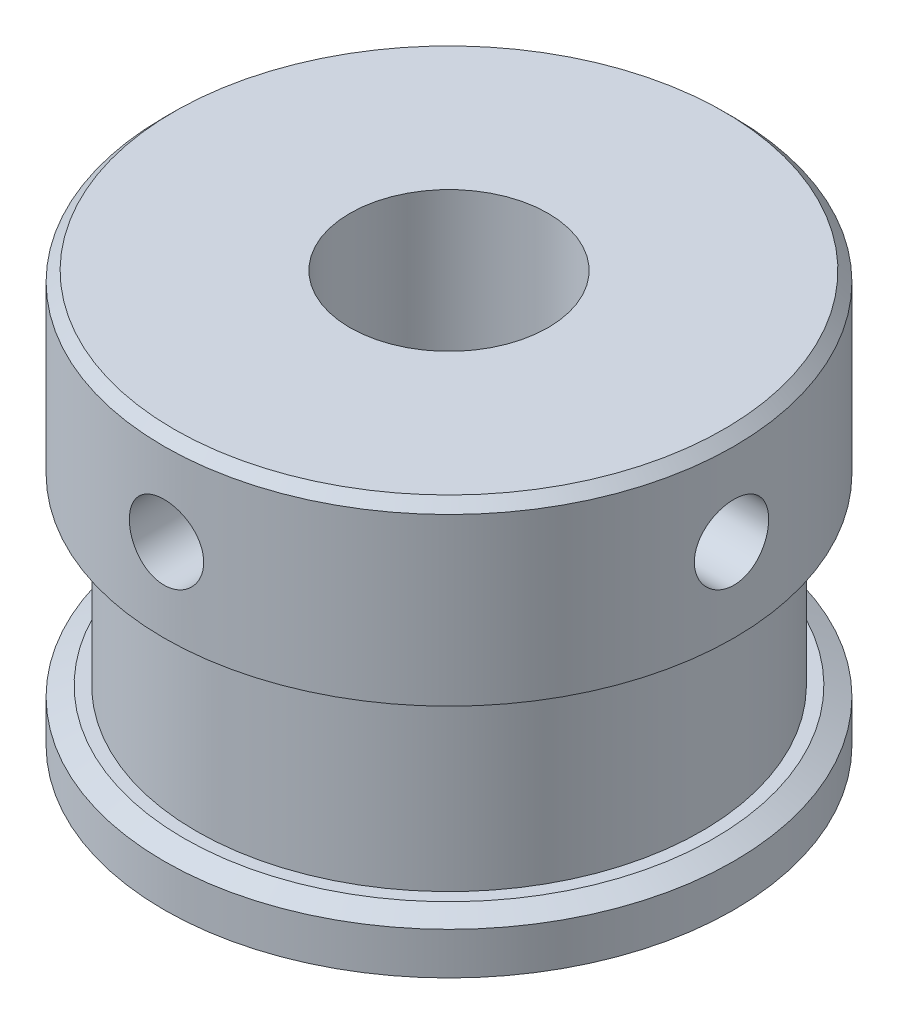
ISO-10303-21;
HEADER;
FILE_DESCRIPTION(('STEP AP214'),'2;1');
FILE_NAME('part.step','',(''),(''),'','','');
FILE_SCHEMA(('AUTOMOTIVE_DESIGN { 1 0 10303 214 1 1 1 1 }'));
ENDSEC;
DATA;
#1=APPLICATION_CONTEXT('core data for automotive mechanical design processes');
#2=APPLICATION_PROTOCOL_DEFINITION('international standard','automotive_design',2000,#1);
#3=PRODUCT_CONTEXT('',#1,'mechanical');
#4=PRODUCT('Part','Part','',(#3));
#5=PRODUCT_RELATED_PRODUCT_CATEGORY('part','',(#4));
#6=PRODUCT_DEFINITION_FORMATION('','',#4);
#7=PRODUCT_DEFINITION_CONTEXT('part definition',#1,'design');
#8=PRODUCT_DEFINITION('design','',#6,#7);
#9=PRODUCT_DEFINITION_SHAPE('','',#8);
#10=(LENGTH_UNIT() NAMED_UNIT(*) SI_UNIT(.MILLI.,.METRE.));
#11=(NAMED_UNIT(*) PLANE_ANGLE_UNIT() SI_UNIT($,.RADIAN.));
#12=(NAMED_UNIT(*) SI_UNIT($,.STERADIAN.) SOLID_ANGLE_UNIT());
#13=UNCERTAINTY_MEASURE_WITH_UNIT(LENGTH_MEASURE(1.E-05),#10,'distance_accuracy_value','');
#14=(GEOMETRIC_REPRESENTATION_CONTEXT(3) GLOBAL_UNCERTAINTY_ASSIGNED_CONTEXT((#13)) GLOBAL_UNIT_ASSIGNED_CONTEXT((#10,
#11,#12)) REPRESENTATION_CONTEXT('',''));
#15=CARTESIAN_POINT('',(0.,0.,0.));
#16=DIRECTION('',(0.,0.,1.));
#17=DIRECTION('',(1.,0.,0.));
#18=AXIS2_PLACEMENT_3D('',#15,#16,#17);
#19=CARTESIAN_POINT('',(0.,-3.15877434078089,0.));
#20=DIRECTION('',(0.,1.,0.));
#21=DIRECTION('',(0.,0.,1.));
#22=AXIS2_PLACEMENT_3D('',#19,#20,#21);
#23=CYLINDRICAL_SURFACE('',#22,4.);
#24=CARTESIAN_POINT('',(0.,3.25,4.));
#25=CARTESIAN_POINT('',(0.0812350589378529,3.24999709769689,4.00000217456151));
#26=CARTESIAN_POINT('',(0.162450241781792,3.25661976024838,3.99750379283184));
#27=CARTESIAN_POINT('',(0.322453452352361,3.28282819526993,3.98778696006928));
#28=CARTESIAN_POINT('',(0.401241827987616,3.30241210047057,3.98056918893993));
#29=CARTESIAN_POINT('',(0.554060784990879,3.35375300177176,3.96218832391545));
#30=CARTESIAN_POINT('',(0.628100224162277,3.38548651682179,3.9510328434944));
#31=CARTESIAN_POINT('',(0.769799310160254,3.46010641301582,3.92588767765353));
#32=CARTESIAN_POINT('',(0.83745723917788,3.50299578554415,3.91189723227547));
#33=CARTESIAN_POINT('',(0.967346417045826,3.60061253107091,3.88186246971216));
#34=CARTESIAN_POINT('',(1.02927073015119,3.6557302622594,3.86576002583566));
#35=CARTESIAN_POINT('',(1.14324421474363,3.77541043465884,3.83360220871327));
#36=CARTESIAN_POINT('',(1.19529036359203,3.83997575608787,3.81754685135033));
#37=CARTESIAN_POINT('',(1.28998202215985,3.97971746752321,3.78662470617731));
#38=CARTESIAN_POINT('',(1.3321939319576,4.05520436654582,3.77182648820818));
#39=CARTESIAN_POINT('',(1.40318646334084,4.21284835416852,3.74599860237433));
#40=CARTESIAN_POINT('',(1.43197244961239,4.2950027631551,3.73496742975881));
#41=CARTESIAN_POINT('',(1.47408431017549,4.4601167402582,3.71854412824136));
#42=CARTESIAN_POINT('',(1.48799593218558,4.54290503843544,3.71293924350838));
#43=CARTESIAN_POINT('',(1.50179556531648,4.70981615799384,3.70738061461215));
#44=CARTESIAN_POINT('',(1.50168936802631,4.79393841387447,3.70742453659305));
#45=CARTESIAN_POINT('',(1.48790429610018,4.95576952521296,3.71297511632055));
#46=CARTESIAN_POINT('',(1.47503808509003,5.03356090604418,3.71815468871122));
#47=CARTESIAN_POINT('',(1.4374416786833,5.18578715040532,3.73284938059529));
#48=CARTESIAN_POINT('',(1.41270969663258,5.26022150661388,3.74236515298863));
#49=CARTESIAN_POINT('',(1.35163748571904,5.40527706772823,3.76485702190253));
#50=CARTESIAN_POINT('',(1.31508648737101,5.4757994861213,3.77789517988166));
#51=CARTESIAN_POINT('',(1.23156073762698,5.60994573759097,3.80594210139319));
#52=CARTESIAN_POINT('',(1.18458238728897,5.6735671775197,3.82095154457158));
#53=CARTESIAN_POINT('',(1.07781780766549,5.79660366365088,3.85248038859113));
#54=CARTESIAN_POINT('',(1.01738298716955,5.85544864074809,3.8690334745567));
#55=CARTESIAN_POINT('',(0.88731259081902,5.9623379662058,3.90091728164086));
#56=CARTESIAN_POINT('',(0.817675603497364,6.01038065460567,3.91624781465952));
#57=CARTESIAN_POINT('',(0.66972343699242,6.09493039706252,3.9442639480908));
#58=CARTESIAN_POINT('',(0.591290713844719,6.13124758122106,3.95690498259616));
#59=CARTESIAN_POINT('',(0.428836850524583,6.18998260427004,3.97778718326962));
#60=CARTESIAN_POINT('',(0.344818210845767,6.21240661656111,3.98603030341493));
#61=CARTESIAN_POINT('',(0.178375243148665,6.24162278754194,3.99684443228065));
#62=CARTESIAN_POINT('',(0.0961036195622092,6.24918260638251,3.99969369025686));
#63=CARTESIAN_POINT('',(-0.0685724752550243,6.25069106389992,4.00025893700126));
#64=CARTESIAN_POINT('',(-0.150976912983373,6.24464272031677,3.99797606386863));
#65=CARTESIAN_POINT('',(-0.31026204856186,6.21968995769133,3.98871709772643));
#66=CARTESIAN_POINT('',(-0.387233328007336,6.20128845626291,3.98192470962305));
#67=CARTESIAN_POINT('',(-0.536941754957222,6.15281392745268,3.96451477091717));
#68=CARTESIAN_POINT('',(-0.609678350347535,6.12273938205197,3.9538967228203));
#69=CARTESIAN_POINT('',(-0.751247765110156,6.05081358756053,3.92949624407681));
#70=CARTESIAN_POINT('',(-0.819903083557795,6.00864227077661,3.91563000209348));
#71=CARTESIAN_POINT('',(-0.949392711726625,5.91408189682844,3.88626671564664));
#72=CARTESIAN_POINT('',(-1.01022412027045,5.86168906745485,3.87076907009516));
#73=CARTESIAN_POINT('',(-1.12603079874454,5.74459587787573,3.83873329490989));
#74=CARTESIAN_POINT('',(-1.18046154123568,5.6793578172273,3.82218696503729));
#75=CARTESIAN_POINT('',(-1.27771050031903,5.54034861529235,3.79078815746854));
#76=CARTESIAN_POINT('',(-1.32052767414519,5.4665767086115,3.77593583194399));
#77=CARTESIAN_POINT('',(-1.39337773518998,5.31198401322769,3.74966829822463));
#78=CARTESIAN_POINT('',(-1.42335685446918,5.23113525408956,3.73826760328493));
#79=CARTESIAN_POINT('',(-1.46907883466889,5.06499023631217,3.72054032891005));
#80=CARTESIAN_POINT('',(-1.48483050305535,4.97969676380187,3.7142106105749));
#81=CARTESIAN_POINT('',(-1.50086347097839,4.81298384045888,3.70775894792573));
#82=CARTESIAN_POINT('',(-1.50207331495837,4.73166736828311,3.70726444523341));
#83=CARTESIAN_POINT('',(-1.49136715641593,4.57005468372383,3.71158412745292));
#84=CARTESIAN_POINT('',(-1.47945239850124,4.48975837532841,3.71639780898899));
#85=CARTESIAN_POINT('',(-1.44355815630242,4.33495277328345,3.73048141585432));
#86=CARTESIAN_POINT('',(-1.41995798316524,4.26034165375465,3.73961085376663));
#87=CARTESIAN_POINT('',(-1.3616969677992,4.11609449150558,3.76121548297845));
#88=CARTESIAN_POINT('',(-1.32703332944944,4.04645971192986,3.77369151995215));
#89=CARTESIAN_POINT('',(-1.24552075938154,3.91017321030237,3.80139723903965));
#90=CARTESIAN_POINT('',(-1.1981283280301,3.84386920320009,3.81673698440964));
#91=CARTESIAN_POINT('',(-1.09334485729906,3.71985843902879,3.84806246757177));
#92=CARTESIAN_POINT('',(-1.03595064012808,3.66215442521325,3.86404840943145));
#93=CARTESIAN_POINT('',(-0.909080396784623,3.55379804417816,3.89590424609881));
#94=CARTESIAN_POINT('',(-0.839118644212992,3.50369624656533,3.91172104900645));
#95=CARTESIAN_POINT('',(-0.69121322320082,3.41597734472344,3.94054514457031));
#96=CARTESIAN_POINT('',(-0.613268934090621,3.37836121226363,3.95355221851559));
#97=CARTESIAN_POINT('',(-0.447999082002312,3.31562317095167,3.9757429260668));
#98=CARTESIAN_POINT('',(-0.360413422234207,3.2911129353981,3.98473657158356));
#99=CARTESIAN_POINT('',(-0.181875733606381,3.25830704007932,3.99686242179587));
#100=CARTESIAN_POINT('',(-0.0909254163648584,3.25000324851268,3.99999756603967));
#101=CARTESIAN_POINT('',(0.,3.25,4.));
#102=B_SPLINE_CURVE_WITH_KNOTS('',3,(#24,#25,#26,#27,#28,#29,#30,#31,#32,#33,#34,#35,#36,#37,
#38,#39,#40,#41,#42,#43,#44,#45,#46,#47,#48,#49,#50,#51,#52,#53,#54,#55,#56,#57,#58,#59,#60,#61,
#62,#63,#64,#65,#66,#67,#68,#69,#70,#71,#72,#73,#74,#75,#76,#77,#78,#79,#80,#81,#82,#83,#84,#85,
#86,#87,#88,#89,#90,#91,#92,#93,#94,#95,#96,#97,#98,#99,#100,#101),.UNSPECIFIED.,.T.,.F.,(4,2,2,
2,2,2,2,2,2,2,2,2,2,2,2,2,2,2,2,2,2,2,2,2,2,2,2,2,2,2,2,2,2,2,2,2,2,2,4),(0.,0.24336980156056,
0.48670454953046,0.729571369213573,0.972503379609491,1.22473618582715,1.47704604925622,
1.73896674501658,2.00078269352133,2.25185874416901,2.50283106079707,2.73878345119971,
2.97477138060589,3.21522408387018,3.45575990744258,3.71246153335813,3.96920257905066,
4.22991375286075,4.49050899698846,4.73725019635925,4.9839366839052,5.2211443792384,
5.45838293254453,5.70259221859599,5.94689180019868,6.20536519455657,6.46386178920141,
6.72343066727204,6.98283874956507,7.22558763480252,7.46831350211259,7.70363142426534,
7.93900886656507,8.18672471884271,8.43451941997062,8.69572329654039,8.95694749805102,
9.22948515032042,9.50188601796128),.UNSPECIFIED.);
#103=CARTESIAN_POINT('',(0.,3.25,4.));
#104=VERTEX_POINT('',#103);
#105=EDGE_CURVE('E64',#104,#104,#102,.T.);
#106=ORIENTED_EDGE('',*,*,#105,.T.);
#107=EDGE_LOOP('',(#106));
#108=FACE_BOUND('',#107,.T.);
#109=CARTESIAN_POINT('',(0.,8.5,0.));
#110=DIRECTION('',(0.,1.,0.));
#111=DIRECTION('',(0.,0.,1.));
#112=AXIS2_PLACEMENT_3D('',#109,#110,#111);
#113=CIRCLE('',#112,4.);
#114=CARTESIAN_POINT('',(0.,8.5,4.));
#115=VERTEX_POINT('',#114);
#116=EDGE_CURVE('E140',#115,#115,#113,.T.);
#117=ORIENTED_EDGE('',*,*,#116,.T.);
#118=EDGE_LOOP('',(#117));
#119=FACE_BOUND('',#118,.T.);
#120=CARTESIAN_POINT('',(0.,-8.5,0.));
#121=DIRECTION('',(0.,1.,0.));
#122=DIRECTION('',(0.,0.,1.));
#123=AXIS2_PLACEMENT_3D('',#120,#121,#122);
#124=CIRCLE('',#123,4.);
#125=CARTESIAN_POINT('',(0.,-8.5,4.));
#126=VERTEX_POINT('',#125);
#127=EDGE_CURVE('E143',#126,#126,#124,.T.);
#128=ORIENTED_EDGE('',*,*,#127,.F.);
#129=EDGE_LOOP('',(#128));
#130=FACE_BOUND('',#129,.T.);
#131=CARTESIAN_POINT('',(3.70809924354783,4.75,-1.5));
#132=CARTESIAN_POINT('',(3.70809640633806,4.83100748372079,-1.50000304106109));
#133=CARTESIAN_POINT('',(3.71078260240986,4.91199492250364,-1.49341597549487));
#134=CARTESIAN_POINT('',(3.72116159304967,5.0715280829132,-1.46736187895468));
#135=CARTESIAN_POINT('',(3.72885423767112,5.15007387759501,-1.44789523373263));
#136=CARTESIAN_POINT('',(3.748254802809,5.30237537161353,-1.39689657610574));
#137=CARTESIAN_POINT('',(3.7599530956926,5.37614205665108,-1.36539347266348));
#138=CARTESIAN_POINT('',(3.78603134206598,5.51737189681884,-1.29131856742698));
#139=CARTESIAN_POINT('',(3.80041210067323,5.58483315028252,-1.24874344095039));
#140=CARTESIAN_POINT('',(3.83103574665713,5.71489031162281,-1.15146661374162));
#141=CARTESIAN_POINT('',(3.84733341923603,5.77712852962939,-1.09630381213306));
#142=CARTESIAN_POINT('',(3.87949750628547,5.89172281467149,-0.976395839778927));
#143=CARTESIAN_POINT('',(3.89536382814785,5.94407677374185,-0.911648630256679));
#144=CARTESIAN_POINT('',(3.92552873936553,6.03913951229561,-0.771694655177598));
#145=CARTESIAN_POINT('',(3.93975561223505,6.08145947471586,-0.696206947538026));
#146=CARTESIAN_POINT('',(3.96438007973848,6.15265117252491,-0.538555771965246));
#147=CARTESIAN_POINT('',(3.97477900217006,6.18152757199198,-0.456394630933535));
#148=CARTESIAN_POINT('',(3.9901869710344,6.22375789577462,-0.291489341676831));
#149=CARTESIAN_POINT('',(3.99540915214774,6.23772762744046,-0.208923197281595));
#150=CARTESIAN_POINT('',(4.0006401410794,6.25172120094499,-0.0424643637947848));
#151=CARTESIAN_POINT('',(4.00065064414902,6.25174957761871,0.0414278850628341));
#152=CARTESIAN_POINT('',(3.99559265903894,6.23821823853482,0.203743543064477));
#153=CARTESIAN_POINT('',(3.99077541996683,6.22533070205118,0.282232178266901));
#154=CARTESIAN_POINT('',(3.97693274932263,6.18746408477445,0.435839217984392));
#155=CARTESIAN_POINT('',(3.96790701975577,6.16248414773796,0.510957383430299));
#156=CARTESIAN_POINT('',(3.9463776916753,6.10082954832416,0.656989017303104));
#157=CARTESIAN_POINT('',(3.93382539470077,6.06398999473159,0.727825392287308));
#158=CARTESIAN_POINT('',(3.90651310225279,5.97980790307061,0.862486607957559));
#159=CARTESIAN_POINT('',(3.8917523951284,5.9324619769824,0.926309176932324));
#160=CARTESIAN_POINT('',(3.86052529655816,5.82537271371682,1.04909048680094));
#161=CARTESIAN_POINT('',(3.84400963763883,5.76506608434958,1.10754614526348));
#162=CARTESIAN_POINT('',(3.81182460645722,5.63540700667844,1.21370395569342));
#163=CARTESIAN_POINT('',(3.79615544748847,5.56605229341336,1.261403406929));
#164=CARTESIAN_POINT('',(3.76712703500335,5.41828053253718,1.34565611808152));
#165=CARTESIAN_POINT('',(3.75382677150277,5.33969650631393,1.38193847851831));
#166=CARTESIAN_POINT('',(3.73172438629002,5.17690377483243,1.44056464441501));
#167=CARTESIAN_POINT('',(3.72291976205783,5.09269822840631,1.46291620605595));
#168=CARTESIAN_POINT('',(3.71139597222848,4.92602403768405,1.49190191709668));
#169=CARTESIAN_POINT('',(3.70836785241537,4.84371589446386,1.49933521158966));
#170=CARTESIAN_POINT('',(3.70786539525016,4.67899064325825,1.50057885636272));
#171=CARTESIAN_POINT('',(3.71038967003987,4.59657356764752,1.49439261093762));
#172=CARTESIAN_POINT('',(3.72039381629735,4.43807007771231,1.46929733520157));
#173=CARTESIAN_POINT('',(3.72763276216449,4.36186886423534,1.45100618334224));
#174=CARTESIAN_POINT('',(3.74596487046362,4.2136520552798,1.40299774640637));
#175=CARTESIAN_POINT('',(3.75705882250173,4.14163732083186,1.37327812034623));
#176=CARTESIAN_POINT('',(3.7823624311608,4.00083556192379,1.30200292275278));
#177=CARTESIAN_POINT('',(3.79667328892065,3.93227070786266,1.26004545177047));
#178=CARTESIAN_POINT('',(3.82662814294291,3.80287101827396,1.16591317862479));
#179=CARTESIAN_POINT('',(3.84227262594077,3.74203902537537,1.11373463696434));
#180=CARTESIAN_POINT('',(3.87433046553184,3.6258316268049,0.996727340900937));
#181=CARTESIAN_POINT('',(3.89072969357028,3.57104659123125,0.93130634149106));
#182=CARTESIAN_POINT('',(3.92149874963302,3.47316163241056,0.79179747175315));
#183=CARTESIAN_POINT('',(3.93586857107664,3.43006174705416,0.717709573322673));
#184=CARTESIAN_POINT('',(3.96094985704552,3.35705394380039,0.563016329468476));
#185=CARTESIAN_POINT('',(3.9716738133801,3.3271008762074,0.482434433064625));
#186=CARTESIAN_POINT('',(3.98829436712571,3.28134358615008,0.316881887523254));
#187=CARTESIAN_POINT('',(3.99419323299413,3.2655327145776,0.231913320723592));
#188=CARTESIAN_POINT('',(4.00028407317073,3.24922559724517,0.0653355852738155));
#189=CARTESIAN_POINT('',(4.00078860953764,3.24789051694101,-0.0161807680608452));
#190=CARTESIAN_POINT('',(3.99684889809223,3.25841515944539,-0.178226786412424));
#191=CARTESIAN_POINT('',(3.9924052471313,3.27027329088586,-0.258756569245257));
#192=CARTESIAN_POINT('',(3.97921089603771,3.30625885149362,-0.414548248377126));
#193=CARTESIAN_POINT('',(3.97056791378017,3.33007990587836,-0.489890731068834));
#194=CARTESIAN_POINT('',(3.9498778362099,3.38901001338436,-0.635515473006389));
#195=CARTESIAN_POINT('',(3.93783009655664,3.42412120330475,-0.705796771275543));
#196=CARTESIAN_POINT('',(3.91090618300074,3.50631394350481,-0.842540176994412));
#197=CARTESIAN_POINT('',(3.89593240108829,3.55383664051415,-0.908717548846849));
#198=CARTESIAN_POINT('',(3.86499507694844,3.6588078301876,-1.03241734752336));
#199=CARTESIAN_POINT('',(3.84903118274027,3.71625986580787,-1.0899366712559));
#200=CARTESIAN_POINT('',(3.81688129739175,3.84306413164506,-1.19781214236196));
#201=CARTESIAN_POINT('',(3.8007280534916,3.91288440215431,-1.24762999816025));
#202=CARTESIAN_POINT('',(3.77098325003638,4.06041586957333,-1.33484709556843));
#203=CARTESIAN_POINT('',(3.75739195631216,4.13812788405348,-1.37224504878157));
#204=CARTESIAN_POINT('',(3.73402269853266,4.3029556809754,-1.4346588697426));
#205=CARTESIAN_POINT('',(3.7244380329086,4.39033436651178,-1.45906002899523));
#206=CARTESIAN_POINT('',(3.71147994336315,4.56848527195579,-1.49172356722079));
#207=CARTESIAN_POINT('',(3.70810242179736,4.65925521270999,-1.4999965933957));
#208=CARTESIAN_POINT('',(3.70809924354783,4.75,-1.5));
#209=B_SPLINE_CURVE_WITH_KNOTS('',3,(#131,#132,#133,#134,#135,#136,#137,#138,#139,#140,#141,
#142,#143,#144,#145,#146,#147,#148,#149,#150,#151,#152,#153,#154,#155,#156,#157,#158,#159,#160,
#161,#162,#163,#164,#165,#166,#167,#168,#169,#170,#171,#172,#173,#174,#175,#176,#177,#178,#179,
#180,#181,#182,#183,#184,#185,#186,#187,#188,#189,#190,#191,#192,#193,#194,#195,#196,#197,#198,
#199,#200,#201,#202,#203,#204,#205,#206,#207,#208),.UNSPECIFIED.,.T.,.F.,(4,2,2,2,2,2,2,2,2,2,2,
2,2,2,2,2,2,2,2,2,2,2,2,2,2,2,2,2,2,2,2,2,2,2,2,2,2,2,4),(0.,0.242684541416171,
0.485361814598856,0.727459856757029,0.969630679682929,1.22274652401128,1.47591628822983,
1.73770072136421,1.9993942638133,2.24980018489679,2.50012465404857,2.73806472803194,
2.97602165263335,3.21744131210668,3.45893893628976,3.71456675065874,3.97025867827334,
4.23162592252966,4.49284751635474,4.73965657740485,4.98640395388885,5.22143845928199,
5.45652113429527,5.70041561005822,5.94439948466356,6.20385016993624,6.46330169650178,
6.72185508890169,6.98028685560127,7.22365720549936,7.4669982031948,7.70440274003891,
7.94185223512831,8.18928323676987,8.43680270894965,8.69738599542079,8.95799630544243,
9.23003178870927,9.50188762323054),.UNSPECIFIED.);
#210=CARTESIAN_POINT('',(3.70809924354783,4.75,-1.5));
#211=VERTEX_POINT('',#210);
#212=EDGE_CURVE('E72',#211,#211,#209,.T.);
#213=ORIENTED_EDGE('',*,*,#212,.T.);
#214=EDGE_LOOP('',(#213));
#215=FACE_BOUND('',#214,.T.);
#216=ADVANCED_FACE('F15',(#108,#119,#130,#215),#23,.F.);
#217=CARTESIAN_POINT('',(0.,-3.15877434078089,0.));
#218=DIRECTION('',(0.,1.,0.));
#219=DIRECTION('',(0.,0.,1.));
#220=AXIS2_PLACEMENT_3D('',#217,#218,#219);
#221=CYLINDRICAL_SURFACE('',#220,11.5);
#222=CARTESIAN_POINT('',(0.,8.1,0.));
#223=DIRECTION('',(0.,1.,0.));
#224=DIRECTION('',(0.,0.,1.));
#225=AXIS2_PLACEMENT_3D('',#222,#223,#224);
#226=CIRCLE('',#225,11.5);
#227=CARTESIAN_POINT('',(0.,8.1,11.5));
#228=VERTEX_POINT('',#227);
#229=EDGE_CURVE('E35',#228,#228,#226,.F.);
#230=ORIENTED_EDGE('',*,*,#229,.T.);
#231=EDGE_LOOP('',(#230));
#232=FACE_BOUND('',#231,.T.);
#233=CARTESIAN_POINT('',(0.,1.4,0.));
#234=DIRECTION('',(0.,-1.,0.));
#235=DIRECTION('',(0.,0.,-1.));
#236=AXIS2_PLACEMENT_3D('',#233,#234,#235);
#237=CIRCLE('',#236,11.5);
#238=CARTESIAN_POINT('',(0.,1.4,-11.5));
#239=VERTEX_POINT('',#238);
#240=EDGE_CURVE('E150',#239,#239,#237,.F.);
#241=ORIENTED_EDGE('',*,*,#240,.T.);
#242=EDGE_LOOP('',(#241));
#243=FACE_BOUND('',#242,.T.);
#244=CARTESIAN_POINT('',(0.,3.25,11.5));
#245=CARTESIAN_POINT('',(-0.0838736754757252,3.25000354399215,11.4999987889706));
#246=CARTESIAN_POINT('',(-0.167799007864497,3.2570585190022,11.4990727424738));
#247=CARTESIAN_POINT('',(-0.333312197058574,3.28508962832946,11.4954676443032));
#248=CARTESIAN_POINT('',(-0.414897556062014,3.30608010041327,11.4927867872035));
#249=CARTESIAN_POINT('',(-0.573310862574351,3.36135143122372,11.4859739305166));
#250=CARTESIAN_POINT('',(-0.650142050157414,3.39562312019119,11.4818429323362));
#251=CARTESIAN_POINT('',(-0.796948541825191,3.47646348354348,11.4725886401554));
#252=CARTESIAN_POINT('',(-0.866924973730809,3.52303013034987,11.4674655098059));
#253=CARTESIAN_POINT('',(-0.998467584282093,3.62743570318059,11.4567642658025));
#254=CARTESIAN_POINT('',(-1.05998690599808,3.68533343735681,11.4511838707794));
#255=CARTESIAN_POINT('',(-1.17246528720072,3.81063133213304,11.4402153265713));
#256=CARTESIAN_POINT('',(-1.22342379516468,3.87803198870026,11.4348271874387));
#257=CARTESIAN_POINT('',(-1.31351024770353,4.0207291928448,11.4248308534604));
#258=CARTESIAN_POINT('',(-1.35259398609595,4.09605387217162,11.4202256004087));
#259=CARTESIAN_POINT('',(-1.41753910895756,4.25226794545653,11.4123468049196));
#260=CARTESIAN_POINT('',(-1.44340103860288,4.3331571098176,11.4090732075752));
#261=CARTESIAN_POINT('',(-1.48102535604963,4.49771622469038,11.4042503168758));
#262=CARTESIAN_POINT('',(-1.49286711031844,4.58136773971687,11.4026913209814));
#263=CARTESIAN_POINT('',(-1.50236057802514,4.74948411506375,11.4014445124782));
#264=CARTESIAN_POINT('',(-1.50001291116,4.83394893970347,11.4017566181525));
#265=CARTESIAN_POINT('',(-1.48125926874543,5.00073965657812,11.4042078698223));
#266=CARTESIAN_POINT('',(-1.46494091291054,5.08307559181959,11.406335628348));
#267=CARTESIAN_POINT('',(-1.41884591021787,5.2438304238629,11.4121606755201));
#268=CARTESIAN_POINT('',(-1.38906896860545,5.32224923483459,11.4158579985412));
#269=CARTESIAN_POINT('',(-1.3168084945362,5.47321485926695,11.4244184254903));
#270=CARTESIAN_POINT('',(-1.27428708175248,5.54574333651292,11.4292849960909));
#271=CARTESIAN_POINT('',(-1.17777176527459,5.68266848096279,11.4396329366713));
#272=CARTESIAN_POINT('',(-1.12377729049832,5.7470647431238,11.4451143372484));
#273=CARTESIAN_POINT('',(-1.0053638994736,5.86640590602694,11.4561248839528));
#274=CARTESIAN_POINT('',(-0.940869497437091,5.921275931088,11.4616540786179));
#275=CARTESIAN_POINT('',(-0.803546382709095,6.01942340252412,11.4720986286903));
#276=CARTESIAN_POINT('',(-0.730717647775682,6.06270081796083,11.4770139824593));
#277=CARTESIAN_POINT('',(-0.578734018158975,6.13643540224873,11.485680465931));
#278=CARTESIAN_POINT('',(-0.499576715280774,6.16688766288078,11.4894311497676));
#279=CARTESIAN_POINT('',(-0.337212307082087,6.214046930639,11.4953417256298));
#280=CARTESIAN_POINT('',(-0.254005408543474,6.23075463881603,11.4975016987903));
#281=CARTESIAN_POINT('',(-0.0865509170952038,6.24985297755592,11.4999768972913));
#282=CARTESIAN_POINT('',(-0.00231527186090646,6.25234671076989,11.500305406974));
#283=CARTESIAN_POINT('',(0.165372777140061,6.24321871999351,11.4991165911979));
#284=CARTESIAN_POINT('',(0.248825199059477,6.23159732396734,11.497599308626));
#285=CARTESIAN_POINT('',(0.41227203547529,6.19465463600026,11.4928976520939));
#286=CARTESIAN_POINT('',(0.492277798076533,6.16938272179502,11.4897192880654));
#287=CARTESIAN_POINT('',(0.646915860586773,6.10590785904702,11.48205116634));
#288=CARTESIAN_POINT('',(0.721547963291774,6.06770443623336,11.4775613605459));
#289=CARTESIAN_POINT('',(0.863779209036494,5.97920309552063,11.4677374606315));
#290=CARTESIAN_POINT('',(0.931336693285052,5.92883874473718,11.4623987859822));
#291=CARTESIAN_POINT('',(1.05707662855491,5.81753888637903,11.4514881052812));
#292=CARTESIAN_POINT('',(1.11525867281433,5.75660292038336,11.4459160891191));
#293=CARTESIAN_POINT('',(1.22096386356526,5.6254344134895,11.435125505803));
#294=CARTESIAN_POINT('',(1.26841850564583,5.55514643909559,11.4299093510067));
#295=CARTESIAN_POINT('',(1.35084798726361,5.40753706704748,11.4204613909882));
#296=CARTESIAN_POINT('',(1.38582309548538,5.33021582086472,11.416229564574));
#297=CARTESIAN_POINT('',(1.44219073788251,5.1709524053382,11.4092460653582));
#298=CARTESIAN_POINT('',(1.46362137263959,5.0890239105499,11.4064902439233));
#299=CARTESIAN_POINT('',(1.49241416148136,4.92269273085984,11.4027590627917));
#300=CARTESIAN_POINT('',(1.49977703312959,4.83829017237725,11.4017836122826));
#301=CARTESIAN_POINT('',(1.50021133318705,4.67008850104974,11.4017264204224));
#302=CARTESIAN_POINT('',(1.49339039767638,4.58628965071037,11.4026304165807));
#303=CARTESIAN_POINT('',(1.46587918768881,4.42104056014688,11.4061995300276));
#304=CARTESIAN_POINT('',(1.44518891595683,4.33959031945794,11.4088646469677));
#305=CARTESIAN_POINT('',(1.39056092558024,4.1813678851861,11.4156511823152));
#306=CARTESIAN_POINT('',(1.35662887172567,4.10459370741389,11.4197719779168));
#307=CARTESIAN_POINT('',(1.27649110130535,3.95781135393139,11.4290065281123));
#308=CARTESIAN_POINT('',(1.23028517717279,3.88780329267208,11.4341202994982));
#309=CARTESIAN_POINT('',(1.12651352497628,3.75599083285157,11.4448110546929));
#310=CARTESIAN_POINT('',(1.06886765466831,3.69424977382771,11.4503911357269));
#311=CARTESIAN_POINT('',(0.944020432211532,3.5812769065544,11.4613587220616));
#312=CARTESIAN_POINT('',(0.876816837734325,3.5300475713594,11.4667461817993));
#313=CARTESIAN_POINT('',(0.73444098320872,3.43936981300331,11.4767463223463));
#314=CARTESIAN_POINT('',(0.659236923265527,3.39997097741548,11.4813557074918));
#315=CARTESIAN_POINT('',(0.503260285581701,3.33441873478558,11.4892472513977));
#316=CARTESIAN_POINT('',(0.42249380864476,3.30825107073332,11.4925308379763));
#317=CARTESIAN_POINT('',(0.28443348518244,3.27610206984066,11.4966176944656));
#318=CARTESIAN_POINT('',(0.228006817894465,3.26632803844139,11.4978798128957));
#319=CARTESIAN_POINT('',(0.114394773946346,3.25327582179697,11.4995713752256));
#320=CARTESIAN_POINT('',(0.0572094035825724,3.24999758267804,11.5000008260312));
#321=CARTESIAN_POINT('',(0.,3.25,11.5));
#322=B_SPLINE_CURVE_WITH_KNOTS('',3,(#244,#245,#246,#247,#248,#249,#250,#251,#252,#253,#254,
#255,#256,#257,#258,#259,#260,#261,#262,#263,#264,#265,#266,#267,#268,#269,#270,#271,#272,#273,
#274,#275,#276,#277,#278,#279,#280,#281,#282,#283,#284,#285,#286,#287,#288,#289,#290,#291,#292,
#293,#294,#295,#296,#297,#298,#299,#300,#301,#302,#303,#304,#305,#306,#307,#308,#309,#310,#311,
#312,#313,#314,#315,#316,#317,#318,#319,#320,#321),.UNSPECIFIED.,.T.,.F.,(4,2,2,2,2,2,2,2,2,2,2,
2,2,2,2,2,2,2,2,2,2,2,2,2,2,2,2,2,2,2,2,2,2,2,2,2,2,2,4),(0.,0.251412042547942,
0.503083156235433,0.754580817165456,1.00603702914676,1.25883466510262,1.51164549971165,
1.76538625583092,2.01911654858878,2.27140353166933,2.5236794966577,2.77438476136928,
3.02509551700844,3.27655897620065,3.52803495514876,3.78140588995842,4.03477750095758,
4.28824598999313,4.54170154988325,4.79331627883385,5.04492516164319,5.29562994105651,
5.5463439162159,5.79845977877204,6.05058657665796,6.30428060859514,6.55796917816597,
6.8109409082131,7.06389973442205,7.31494594958269,7.56599211505811,7.81693100134903,
8.06787413160716,8.32064158523561,8.57346843851719,8.82734068052478,9.08093878097965,
9.25242586815101,9.42391153306392),.UNSPECIFIED.);
#323=CARTESIAN_POINT('',(0.,3.25,11.5));
#324=VERTEX_POINT('',#323);
#325=EDGE_CURVE('E27',#324,#324,#322,.T.);
#326=ORIENTED_EDGE('',*,*,#325,.T.);
#327=EDGE_LOOP('',(#326));
#328=FACE_BOUND('',#327,.T.);
#329=CARTESIAN_POINT('',(11.4017542509914,4.75,-1.5));
#330=CARTESIAN_POINT('',(11.4017555010927,4.66612974605351,-1.49999645301449));
#331=CARTESIAN_POINT('',(11.4026896606142,4.58220782531927,-1.49294203416221));
#332=CARTESIAN_POINT('',(11.4063237260242,4.41670172381516,-1.46491333453698));
#333=CARTESIAN_POINT('',(11.4090254521656,4.33512004354479,-1.44392470388228));
#334=CARTESIAN_POINT('',(11.4158835494573,4.17671451862598,-1.3886587589991));
#335=CARTESIAN_POINT('',(11.4200389070908,4.09988740275981,-1.3543907018073));
#336=CARTESIAN_POINT('',(11.4293348464697,3.95308774393182,-1.27355889313978));
#337=CARTESIAN_POINT('',(11.4344752664174,3.88311407813169,-1.22699716043963));
#338=CARTESIAN_POINT('',(11.445197137233,3.75156838698374,-1.12259656958886));
#339=CARTESIAN_POINT('',(11.450780832969,3.69004408459846,-1.06469780379541));
#340=CARTESIAN_POINT('',(11.4617399588797,3.57755607833825,-0.93939574879159));
#341=CARTESIAN_POINT('',(11.4671153784681,3.52659291069305,-0.871991977267098));
#342=CARTESIAN_POINT('',(11.4770753814867,3.43650155148103,-0.72929200134848));
#343=CARTESIAN_POINT('',(11.4816570418954,3.39741671965129,-0.65396820109262));
#344=CARTESIAN_POINT('',(11.4894885821545,3.33246933335581,-0.497756037054306));
#345=CARTESIAN_POINT('',(11.4927385156426,3.30660624635005,-0.41686789753894));
#346=CARTESIAN_POINT('',(11.4975246059022,3.26897956068909,-0.252312093764223));
#347=CARTESIAN_POINT('',(11.4990704204953,3.25713647735637,-0.168662889559621));
#348=CARTESIAN_POINT('',(11.5003071067839,3.24763955068957,-0.000551051593618865));
#349=CARTESIAN_POINT('',(11.4999980575609,3.24998510242647,0.0839115473356046));
#350=CARTESIAN_POINT('',(11.4975676318304,3.26873536177967,0.250711499958837));
#351=CARTESIAN_POINT('',(11.495457275758,3.28505458012217,0.333058646852886));
#352=CARTESIAN_POINT('',(11.4896737037343,3.3311551807269,0.493835455554849));
#353=CARTESIAN_POINT('',(11.4860004558634,3.36093683793923,0.572265037316048));
#354=CARTESIAN_POINT('',(11.4774848372199,3.43320714577404,0.723243851165393));
#355=CARTESIAN_POINT('',(11.4726390893116,3.47573258809549,0.795775273641202));
#356=CARTESIAN_POINT('',(11.4623201935655,3.57225654245436,0.932704606534635));
#357=CARTESIAN_POINT('',(11.4568470144162,3.62625562718919,0.997102110698519));
#358=CARTESIAN_POINT('',(11.4458372756446,3.74467233134334,1.11643819513605));
#359=CARTESIAN_POINT('',(11.4403005474487,3.8091644846265,1.17130282662102));
#360=CARTESIAN_POINT('',(11.4298278324284,3.9464811631493,1.2694404810369));
#361=CARTESIAN_POINT('',(11.4248918478017,4.01930571887019,1.31271346156177));
#362=CARTESIAN_POINT('',(11.4161795912173,4.17128812702736,1.38644483776161));
#363=CARTESIAN_POINT('',(11.4124038861902,4.25044905177646,1.41689697165318));
#364=CARTESIAN_POINT('',(11.4064505206359,4.41282134575287,1.46405488015557));
#365=CARTESIAN_POINT('',(11.4042727759921,4.49603250153029,1.48076137834162));
#366=CARTESIAN_POINT('',(11.4017774109739,4.66348911375159,1.49985514370483));
#367=CARTESIAN_POINT('',(11.4014462521966,4.74772249239381,1.50234663257981));
#368=CARTESIAN_POINT('',(11.4026457215703,4.91540547241168,1.49321496203163));
#369=CARTESIAN_POINT('',(11.4041763064158,4.99885509197255,1.48159213091645));
#370=CARTESIAN_POINT('',(11.4089144348313,5.16228727005644,1.44464963434861));
#371=CARTESIAN_POINT('',(11.4121157621508,5.24228149832657,1.41938072914779));
#372=CARTESIAN_POINT('',(11.4198296111094,5.39689781992073,1.35591573806608));
#373=CARTESIAN_POINT('',(11.4243421826685,5.47151970858118,1.31771916001082));
#374=CARTESIAN_POINT('',(11.4342023912125,5.61374376689708,1.22922802110626));
#375=CARTESIAN_POINT('',(11.4395546717525,5.6813031952319,1.17886529183312));
#376=CARTESIAN_POINT('',(11.4504767766229,5.80704780596861,1.06756750174708));
#377=CARTESIAN_POINT('',(11.4560466101759,5.86523259042251,1.00663199235394));
#378=CARTESIAN_POINT('',(11.4668179794224,5.97094402888092,0.875462338341593));
#379=CARTESIAN_POINT('',(11.4720170065382,6.01840207901289,0.805172669271245));
#380=CARTESIAN_POINT('',(11.4814231748458,6.10083753540956,0.657558967858983));
#381=CARTESIAN_POINT('',(11.4856303375335,6.13581521216149,0.580235088015154));
#382=CARTESIAN_POINT('',(11.4925676402684,6.19218448448026,0.420973071168352));
#383=CARTESIAN_POINT('',(11.4953020399787,6.21361529312715,0.339049006517434));
#384=CARTESIAN_POINT('',(11.4990034533124,6.24240992971606,0.172727196515987));
#385=CARTESIAN_POINT('',(11.4999705540811,6.24977445126499,0.088329573344706));
#386=CARTESIAN_POINT('',(11.5000279000696,6.25021369871507,-0.0798746769516785));
#387=CARTESIAN_POINT('',(11.4991320170928,6.24339404014946,-0.163681043071283));
#388=CARTESIAN_POINT('',(11.4955917059201,6.21588274606021,-0.32894549153864));
#389=CARTESIAN_POINT('',(11.4929472797203,6.19519112637328,-0.41040357656716));
#390=CARTESIAN_POINT('',(11.4862056490748,6.14055733378628,-0.568642219855317));
#391=CARTESIAN_POINT('',(11.4821090502512,6.10662068407239,-0.645424712431707));
#392=CARTESIAN_POINT('',(11.4729159452671,6.02647113767378,-0.792221787328595));
#393=CARTESIAN_POINT('',(11.4678194229654,5.98025804281329,-0.862236260369662));
#394=CARTESIAN_POINT('',(11.4571496362498,5.87647834381003,-0.994048728546037));
#395=CARTESIAN_POINT('',(11.4515732358813,5.8188332476528,-1.05578467493496));
#396=CARTESIAN_POINT('',(11.4405969587125,5.69398969875132,-1.16874758745896));
#397=CARTESIAN_POINT('',(11.4351971239349,5.62678899182308,-1.2199720669361));
#398=CARTESIAN_POINT('',(11.425161148306,5.48441564651668,-1.31064441090517));
#399=CARTESIAN_POINT('',(11.4205283132887,5.40921068337355,-1.35004186374931));
#400=CARTESIAN_POINT('',(11.4125895944072,5.25323216464592,-1.41559127347486));
#401=CARTESIAN_POINT('',(11.4092822814234,5.17246471702342,-1.44175750369104));
#402=CARTESIAN_POINT('',(11.4051643222105,5.03440820135864,-1.47390259785781));
#403=CARTESIAN_POINT('',(11.4038919959272,4.97798658642477,-1.48367487173576));
#404=CARTESIAN_POINT('',(11.4021865375875,4.86438465517099,-1.49672475464482));
#405=CARTESIAN_POINT('',(11.4017533983503,4.80720434534723,-1.50000241924847));
#406=CARTESIAN_POINT('',(11.4017542509914,4.75,-1.5));
#407=B_SPLINE_CURVE_WITH_KNOTS('',3,(#329,#330,#331,#332,#333,#334,#335,#336,#337,#338,#339,
#340,#341,#342,#343,#344,#345,#346,#347,#348,#349,#350,#351,#352,#353,#354,#355,#356,#357,#358,
#359,#360,#361,#362,#363,#364,#365,#366,#367,#368,#369,#370,#371,#372,#373,#374,#375,#376,#377,
#378,#379,#380,#381,#382,#383,#384,#385,#386,#387,#388,#389,#390,#391,#392,#393,#394,#395,#396,
#397,#398,#399,#400,#401,#402,#403,#404,#405,#406),.UNSPECIFIED.,.T.,.F.,(4,2,2,2,2,2,2,2,2,2,2,
2,2,2,2,2,2,2,2,2,2,2,2,2,2,2,2,2,2,2,2,2,2,2,2,2,2,2,4),(0.,0.251401763409772,
0.503062830563612,0.754548780434045,1.00599345881713,1.25880454908432,1.51162847240694,
1.76536449581033,2.01909029853277,2.27137063822619,2.52364022208436,2.77437738752206,
3.0251196741212,3.27659295200133,3.52807878491241,3.7814359080699,4.03479395807764,
4.28827560662902,4.54174391096106,4.79335142269097,5.04495308198347,5.29562522352575,
5.54630690957677,5.79842717499934,6.05055813995758,6.30425867142356,6.55795370410217,
6.8109109813241,7.06385578493151,7.31492390374275,7.56599173592654,7.81695498432957,
8.06792228421935,8.32067641903951,8.57349027819167,8.82736691371986,9.08096908946926,
9.25244104378408,9.42391153085533),.UNSPECIFIED.);
#408=CARTESIAN_POINT('',(11.4017542509914,4.75,-1.5));
#409=VERTEX_POINT('',#408);
#410=EDGE_CURVE('E10',#409,#409,#407,.T.);
#411=ORIENTED_EDGE('',*,*,#410,.T.);
#412=EDGE_LOOP('',(#411));
#413=FACE_BOUND('',#412,.T.);
#414=ADVANCED_FACE('F49',(#232,#243,#328,#413),#221,.T.);
#415=CARTESIAN_POINT('',(0.,-3.15877434078089,0.));
#416=DIRECTION('',(0.,1.,0.));
#417=DIRECTION('',(0.,0.,1.));
#418=AXIS2_PLACEMENT_3D('',#415,#416,#417);
#419=CYLINDRICAL_SURFACE('',#418,11.5);
#420=CARTESIAN_POINT('',(0.,-6.4,0.));
#421=DIRECTION('',(0.,1.,0.));
#422=DIRECTION('',(0.,0.,1.));
#423=AXIS2_PLACEMENT_3D('',#420,#421,#422);
#424=CIRCLE('',#423,11.5);
#425=CARTESIAN_POINT('',(0.,-6.4,11.5));
#426=VERTEX_POINT('',#425);
#427=EDGE_CURVE('E114',#426,#426,#424,.F.);
#428=ORIENTED_EDGE('',*,*,#427,.T.);
#429=EDGE_LOOP('',(#428));
#430=FACE_BOUND('',#429,.T.);
#431=CARTESIAN_POINT('',(0.,-8.1,0.));
#432=DIRECTION('',(0.,-1.,0.));
#433=DIRECTION('',(0.,0.,-1.));
#434=AXIS2_PLACEMENT_3D('',#431,#432,#433);
#435=CIRCLE('',#434,11.5);
#436=CARTESIAN_POINT('',(0.,-8.1,-11.5));
#437=VERTEX_POINT('',#436);
#438=EDGE_CURVE('E111',#437,#437,#435,.F.);
#439=ORIENTED_EDGE('',*,*,#438,.T.);
#440=EDGE_LOOP('',(#439));
#441=FACE_BOUND('',#440,.T.);
#442=ADVANCED_FACE('F85',(#430,#441),#419,.T.);
#443=CARTESIAN_POINT('',(0.,-8.5,2.29279304397316));
#444=DIRECTION('',(0.,-1.,0.));
#445=DIRECTION('',(0.,0.,-1.));
#446=AXIS2_PLACEMENT_3D('',#443,#444,#445);
#447=PLANE('',#446);
#448=CARTESIAN_POINT('',(0.,-8.5,0.));
#449=DIRECTION('',(0.,-1.,0.));
#450=DIRECTION('',(0.,0.,-1.));
#451=AXIS2_PLACEMENT_3D('',#448,#449,#450);
#452=CIRCLE('',#451,10.7);
#453=CARTESIAN_POINT('',(0.,-8.5,-10.7));
#454=VERTEX_POINT('',#453);
#455=EDGE_CURVE('E108',#454,#454,#452,.T.);
#456=ORIENTED_EDGE('',*,*,#455,.T.);
#457=EDGE_LOOP('',(#456));
#458=FACE_BOUND('',#457,.T.);
#459=ORIENTED_EDGE('',*,*,#127,.T.);
#460=EDGE_LOOP('',(#459));
#461=FACE_BOUND('',#460,.T.);
#462=ADVANCED_FACE('F81',(#458,#461),#447,.T.);
#463=CARTESIAN_POINT('',(0.,8.5,6.22564207762479));
#464=DIRECTION('',(0.,1.,0.));
#465=DIRECTION('',(0.,0.,1.));
#466=AXIS2_PLACEMENT_3D('',#463,#464,#465);
#467=PLANE('',#466);
#468=CARTESIAN_POINT('',(0.,8.5,0.));
#469=DIRECTION('',(0.,1.,0.));
#470=DIRECTION('',(0.,0.,1.));
#471=AXIS2_PLACEMENT_3D('',#468,#469,#470);
#472=CIRCLE('',#471,11.1);
#473=CARTESIAN_POINT('',(0.,8.5,11.1));
#474=VERTEX_POINT('',#473);
#475=EDGE_CURVE('E43',#474,#474,#472,.T.);
#476=ORIENTED_EDGE('',*,*,#475,.T.);
#477=EDGE_LOOP('',(#476));
#478=FACE_BOUND('',#477,.T.);
#479=ORIENTED_EDGE('',*,*,#116,.F.);
#480=EDGE_LOOP('',(#479));
#481=FACE_BOUND('',#480,.T.);
#482=ADVANCED_FACE('F80',(#478,#481),#467,.T.);
#483=CARTESIAN_POINT('',(0.,1.,6.63810501534939));
#484=DIRECTION('',(0.,-1.,0.));
#485=DIRECTION('',(0.,0.,-1.));
#486=AXIS2_PLACEMENT_3D('',#483,#484,#485);
#487=PLANE('',#486);
#488=CARTESIAN_POINT('',(0.,1.,0.));
#489=DIRECTION('',(0.,-1.,0.));
#490=DIRECTION('',(0.,0.,-1.));
#491=AXIS2_PLACEMENT_3D('',#488,#489,#490);
#492=CIRCLE('',#491,10.7);
#493=CARTESIAN_POINT('',(0.,1.,-10.7));
#494=VERTEX_POINT('',#493);
#495=EDGE_CURVE('E124',#494,#494,#492,.T.);
#496=ORIENTED_EDGE('',*,*,#495,.T.);
#497=EDGE_LOOP('',(#496));
#498=FACE_BOUND('',#497,.T.);
#499=CARTESIAN_POINT('',(0.,1.,0.));
#500=DIRECTION('',(0.,1.,0.));
#501=DIRECTION('',(0.,0.,1.));
#502=AXIS2_PLACEMENT_3D('',#499,#500,#501);
#503=CIRCLE('',#502,10.2);
#504=CARTESIAN_POINT('',(0.,1.,10.2));
#505=VERTEX_POINT('',#504);
#506=EDGE_CURVE('E144',#505,#505,#503,.T.);
#507=ORIENTED_EDGE('',*,*,#506,.T.);
#508=EDGE_LOOP('',(#507));
#509=FACE_BOUND('',#508,.T.);
#510=ADVANCED_FACE('F137',(#498,#509),#487,.T.);
#511=CARTESIAN_POINT('',(0.,-3.15877434078089,0.));
#512=DIRECTION('',(0.,1.,0.));
#513=DIRECTION('',(0.,0.,1.));
#514=AXIS2_PLACEMENT_3D('',#511,#512,#513);
#515=CYLINDRICAL_SURFACE('',#514,10.2);
#516=CARTESIAN_POINT('',(0.,-6.,0.));
#517=DIRECTION('',(0.,1.,0.));
#518=DIRECTION('',(0.,0.,1.));
#519=AXIS2_PLACEMENT_3D('',#516,#517,#518);
#520=CIRCLE('',#519,10.2);
#521=CARTESIAN_POINT('',(0.,-6.,10.2));
#522=VERTEX_POINT('',#521);
#523=EDGE_CURVE('E71',#522,#522,#520,.T.);
#524=ORIENTED_EDGE('',*,*,#523,.T.);
#525=EDGE_LOOP('',(#524));
#526=FACE_BOUND('',#525,.T.);
#527=ORIENTED_EDGE('',*,*,#506,.F.);
#528=EDGE_LOOP('',(#527));
#529=FACE_BOUND('',#528,.T.);
#530=ADVANCED_FACE('F192',(#526,#529),#515,.T.);
#531=CARTESIAN_POINT('',(0.,-6.,6.63810501534939));
#532=DIRECTION('',(0.,1.,0.));
#533=DIRECTION('',(0.,0.,1.));
#534=AXIS2_PLACEMENT_3D('',#531,#532,#533);
#535=PLANE('',#534);
#536=CARTESIAN_POINT('',(0.,-6.,0.));
#537=DIRECTION('',(0.,1.,0.));
#538=DIRECTION('',(0.,0.,1.));
#539=AXIS2_PLACEMENT_3D('',#536,#537,#538);
#540=CIRCLE('',#539,10.7);
#541=CARTESIAN_POINT('',(0.,-6.,10.7));
#542=VERTEX_POINT('',#541);
#543=EDGE_CURVE('E115',#542,#542,#540,.T.);
#544=ORIENTED_EDGE('',*,*,#543,.T.);
#545=EDGE_LOOP('',(#544));
#546=FACE_BOUND('',#545,.T.);
#547=ORIENTED_EDGE('',*,*,#523,.F.);
#548=EDGE_LOOP('',(#547));
#549=FACE_BOUND('',#548,.T.);
#550=ADVANCED_FACE('F60',(#546,#549),#535,.T.);
#551=CARTESIAN_POINT('',(0.,1.4,0.));
#552=DIRECTION('',(0.,1.,0.));
#553=DIRECTION('',(0.,0.,1.));
#554=AXIS2_PLACEMENT_3D('',#551,#552,#553);
#555=CONICAL_SURFACE('',#554,11.5,1.10714871779409);
#556=ORIENTED_EDGE('',*,*,#495,.F.);
#557=EDGE_LOOP('',(#556));
#558=FACE_BOUND('',#557,.T.);
#559=ORIENTED_EDGE('',*,*,#240,.F.);
#560=EDGE_LOOP('',(#559));
#561=FACE_BOUND('',#560,.T.);
#562=ADVANCED_FACE('F90',(#558,#561),#555,.T.);
#563=CARTESIAN_POINT('',(0.,-6.,0.));
#564=DIRECTION('',(0.,-1.,0.));
#565=DIRECTION('',(0.,0.,-1.));
#566=AXIS2_PLACEMENT_3D('',#563,#564,#565);
#567=CONICAL_SURFACE('',#566,10.7,1.10714871779409);
#568=ORIENTED_EDGE('',*,*,#427,.F.);
#569=EDGE_LOOP('',(#568));
#570=FACE_BOUND('',#569,.T.);
#571=ORIENTED_EDGE('',*,*,#543,.F.);
#572=EDGE_LOOP('',(#571));
#573=FACE_BOUND('',#572,.T.);
#574=ADVANCED_FACE('F93',(#570,#573),#567,.T.);
#575=CARTESIAN_POINT('',(0.,-8.1,0.));
#576=DIRECTION('',(0.,1.,0.));
#577=DIRECTION('',(0.,0.,1.));
#578=AXIS2_PLACEMENT_3D('',#575,#576,#577);
#579=CONICAL_SURFACE('',#578,11.5,1.10714871779409);
#580=ORIENTED_EDGE('',*,*,#455,.F.);
#581=EDGE_LOOP('',(#580));
#582=FACE_BOUND('',#581,.T.);
#583=ORIENTED_EDGE('',*,*,#438,.F.);
#584=EDGE_LOOP('',(#583));
#585=FACE_BOUND('',#584,.T.);
#586=ADVANCED_FACE('F96',(#582,#585),#579,.T.);
#587=CARTESIAN_POINT('',(0.,8.5,0.));
#588=DIRECTION('',(0.,-1.,0.));
#589=DIRECTION('',(0.,0.,-1.));
#590=AXIS2_PLACEMENT_3D('',#587,#588,#589);
#591=CONICAL_SURFACE('',#590,11.1,0.785398163397448);
#592=ORIENTED_EDGE('',*,*,#229,.F.);
#593=EDGE_LOOP('',(#592));
#594=FACE_BOUND('',#593,.T.);
#595=ORIENTED_EDGE('',*,*,#475,.F.);
#596=EDGE_LOOP('',(#595));
#597=FACE_BOUND('',#596,.T.);
#598=ADVANCED_FACE('F17',(#594,#597),#591,.T.);
#599=CARTESIAN_POINT('',(0.,4.75,7.00023166122502));
#600=DIRECTION('',(0.,0.,1.));
#601=DIRECTION('',(1.,0.,0.));
#602=AXIS2_PLACEMENT_3D('',#599,#600,#601);
#603=CYLINDRICAL_SURFACE('',#602,1.5);
#604=ORIENTED_EDGE('',*,*,#105,.F.);
#605=EDGE_LOOP('',(#604));
#606=FACE_BOUND('',#605,.T.);
#607=ORIENTED_EDGE('',*,*,#325,.F.);
#608=EDGE_LOOP('',(#607));
#609=FACE_BOUND('',#608,.T.);
#610=ADVANCED_FACE('F53',(#606,#609),#603,.F.);
#611=CARTESIAN_POINT('',(7.00023166122502,4.75,0.));
#612=DIRECTION('',(1.,0.,0.));
#613=DIRECTION('',(0.,0.,-1.));
#614=AXIS2_PLACEMENT_3D('',#611,#612,#613);
#615=CYLINDRICAL_SURFACE('',#614,1.5);
#616=ORIENTED_EDGE('',*,*,#212,.F.);
#617=EDGE_LOOP('',(#616));
#618=FACE_BOUND('',#617,.T.);
#619=ORIENTED_EDGE('',*,*,#410,.F.);
#620=EDGE_LOOP('',(#619));
#621=FACE_BOUND('',#620,.T.);
#622=ADVANCED_FACE('F57',(#618,#621),#615,.F.);
#623=CLOSED_SHELL('',(#216,#414,#442,#462,#482,#510,#530,#550,#562,#574,#586,#598,#610,#622));
#624=MANIFOLD_SOLID_BREP('B1',#623);
#625=ADVANCED_BREP_SHAPE_REPRESENTATION('',(#18,#624),#14);
#626=SHAPE_DEFINITION_REPRESENTATION(#9,#625);
ENDSEC;
END-ISO-10303-21;
